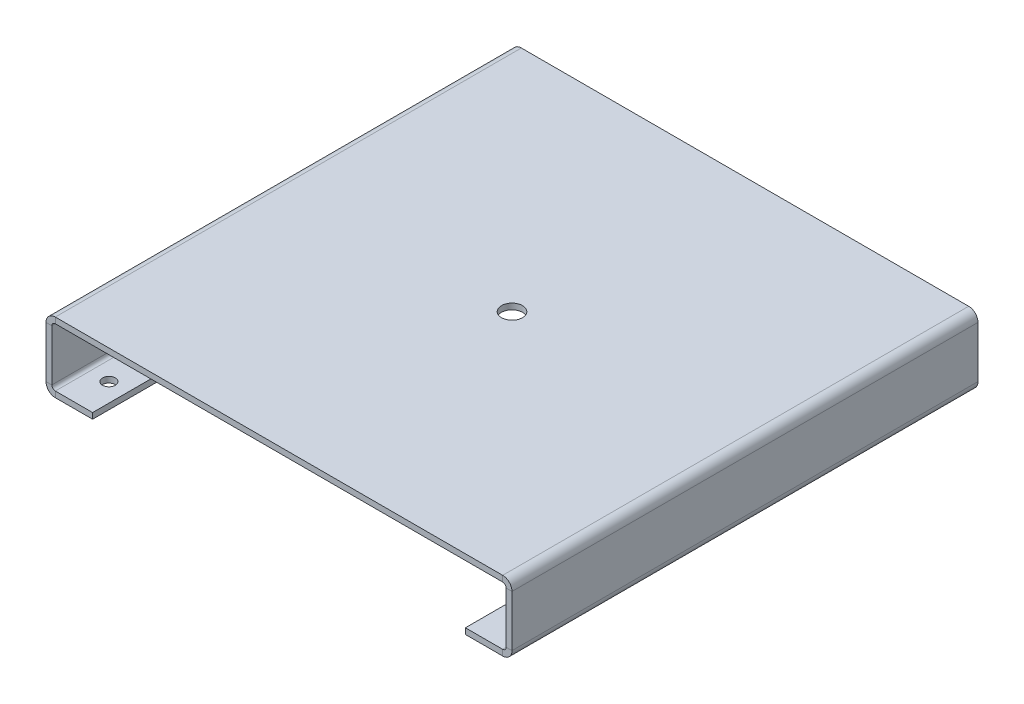
ISO-10303-21;
HEADER;
FILE_DESCRIPTION(('STEP AP214'),'2;1');
FILE_NAME('part.step','',(''),(''),'','','');
FILE_SCHEMA(('AUTOMOTIVE_DESIGN { 1 0 10303 214 1 1 1 1 }'));
ENDSEC;
DATA;
#1=APPLICATION_CONTEXT('core data for automotive mechanical design processes');
#2=APPLICATION_PROTOCOL_DEFINITION('international standard','automotive_design',2000,#1);
#3=PRODUCT_CONTEXT('',#1,'mechanical');
#4=PRODUCT('Part','Part','',(#3));
#5=PRODUCT_RELATED_PRODUCT_CATEGORY('part','',(#4));
#6=PRODUCT_DEFINITION_FORMATION('','',#4);
#7=PRODUCT_DEFINITION_CONTEXT('part definition',#1,'design');
#8=PRODUCT_DEFINITION('design','',#6,#7);
#9=PRODUCT_DEFINITION_SHAPE('','',#8);
#10=(LENGTH_UNIT() NAMED_UNIT(*) SI_UNIT(.MILLI.,.METRE.));
#11=(NAMED_UNIT(*) PLANE_ANGLE_UNIT() SI_UNIT($,.RADIAN.));
#12=(NAMED_UNIT(*) SI_UNIT($,.STERADIAN.) SOLID_ANGLE_UNIT());
#13=UNCERTAINTY_MEASURE_WITH_UNIT(LENGTH_MEASURE(1.E-05),#10,'distance_accuracy_value','');
#14=(GEOMETRIC_REPRESENTATION_CONTEXT(3) GLOBAL_UNCERTAINTY_ASSIGNED_CONTEXT((#13)) GLOBAL_UNIT_ASSIGNED_CONTEXT((#10,
#11,#12)) REPRESENTATION_CONTEXT('',''));
#15=CARTESIAN_POINT('',(0.,0.,0.));
#16=DIRECTION('',(0.,0.,1.));
#17=DIRECTION('',(1.,0.,0.));
#18=AXIS2_PLACEMENT_3D('',#15,#16,#17);
#19=CARTESIAN_POINT('',(12.,4.,-185.));
#20=DIRECTION('',(0.,-1.,0.));
#21=DIRECTION('',(0.,0.,-1.));
#22=AXIS2_PLACEMENT_3D('',#19,#20,#21);
#23=CYLINDRICAL_SURFACE('',#22,2.75);
#24=CARTESIAN_POINT('',(12.,0.,-185.));
#25=DIRECTION('',(0.,-1.,0.));
#26=DIRECTION('',(0.,0.,-1.));
#27=AXIS2_PLACEMENT_3D('',#24,#25,#26);
#28=CIRCLE('',#27,2.75);
#29=CARTESIAN_POINT('',(12.,0.,-187.75));
#30=VERTEX_POINT('',#29);
#31=EDGE_CURVE('E368',#30,#30,#28,.T.);
#32=ORIENTED_EDGE('',*,*,#31,.T.);
#33=EDGE_LOOP('',(#32));
#34=FACE_BOUND('',#33,.T.);
#35=CARTESIAN_POINT('',(12.,2.5,-185.));
#36=DIRECTION('',(0.,-1.,0.));
#37=DIRECTION('',(0.,0.,-1.));
#38=AXIS2_PLACEMENT_3D('',#35,#36,#37);
#39=CIRCLE('',#38,2.75);
#40=CARTESIAN_POINT('',(12.,2.5,-187.75));
#41=VERTEX_POINT('',#40);
#42=EDGE_CURVE('E344',#41,#41,#39,.T.);
#43=ORIENTED_EDGE('',*,*,#42,.F.);
#44=EDGE_LOOP('',(#43));
#45=FACE_BOUND('',#44,.T.);
#46=ADVANCED_FACE('F30',(#34,#45),#23,.F.);
#47=CARTESIAN_POINT('',(12.,4.,-15.));
#48=DIRECTION('',(0.,-1.,0.));
#49=DIRECTION('',(0.,0.,-1.));
#50=AXIS2_PLACEMENT_3D('',#47,#48,#49);
#51=CYLINDRICAL_SURFACE('',#50,2.75);
#52=CARTESIAN_POINT('',(12.,0.,-15.));
#53=DIRECTION('',(0.,-1.,0.));
#54=DIRECTION('',(0.,0.,-1.));
#55=AXIS2_PLACEMENT_3D('',#52,#53,#54);
#56=CIRCLE('',#55,2.75);
#57=CARTESIAN_POINT('',(12.,0.,-17.75));
#58=VERTEX_POINT('',#57);
#59=EDGE_CURVE('E365',#58,#58,#56,.T.);
#60=ORIENTED_EDGE('',*,*,#59,.T.);
#61=EDGE_LOOP('',(#60));
#62=FACE_BOUND('',#61,.T.);
#63=CARTESIAN_POINT('',(12.,2.5,-15.));
#64=DIRECTION('',(0.,-1.,0.));
#65=DIRECTION('',(0.,0.,-1.));
#66=AXIS2_PLACEMENT_3D('',#63,#64,#65);
#67=CIRCLE('',#66,2.75);
#68=CARTESIAN_POINT('',(12.,2.5,-17.75));
#69=VERTEX_POINT('',#68);
#70=EDGE_CURVE('E347',#69,#69,#67,.T.);
#71=ORIENTED_EDGE('',*,*,#70,.F.);
#72=EDGE_LOOP('',(#71));
#73=FACE_BOUND('',#72,.T.);
#74=ADVANCED_FACE('F500',(#62,#73),#51,.F.);
#75=CARTESIAN_POINT('',(20.,403.777958527503,-200.));
#76=DIRECTION('',(-1.,0.,0.));
#77=DIRECTION('',(0.,0.,1.));
#78=AXIS2_PLACEMENT_3D('',#75,#76,#77);
#79=PLANE('',#78);
#80=DIRECTION('',(0.,0.,-1.));
#81=VECTOR('',#80,1.);
#82=CARTESIAN_POINT('',(20.,0.,0.));
#83=LINE('',#82,#81);
#84=CARTESIAN_POINT('',(20.,1.10456723534393E-13,0.));
#85=VERTEX_POINT('',#84);
#86=CARTESIAN_POINT('',(20.,0.,-200.));
#87=VERTEX_POINT('',#86);
#88=EDGE_CURVE('E362',#85,#87,#83,.T.);
#89=ORIENTED_EDGE('',*,*,#88,.T.);
#90=DIRECTION('',(0.,-1.,0.));
#91=VECTOR('',#90,1.);
#92=CARTESIAN_POINT('',(20.,403.777958527503,-200.));
#93=LINE('',#92,#91);
#94=CARTESIAN_POINT('',(20.,2.50000000000011,-200.));
#95=VERTEX_POINT('',#94);
#96=EDGE_CURVE('E350',#95,#87,#93,.T.);
#97=ORIENTED_EDGE('',*,*,#96,.F.);
#98=DIRECTION('',(0.,0.,-1.));
#99=VECTOR('',#98,1.);
#100=CARTESIAN_POINT('',(20.,2.5,-200.));
#101=LINE('',#100,#99);
#102=CARTESIAN_POINT('',(20.,2.5,0.));
#103=VERTEX_POINT('',#102);
#104=EDGE_CURVE('E11',#103,#95,#101,.T.);
#105=ORIENTED_EDGE('',*,*,#104,.F.);
#106=DIRECTION('',(0.,-1.,0.));
#107=VECTOR('',#106,1.);
#108=CARTESIAN_POINT('',(20.,403.777958527503,0.));
#109=LINE('',#108,#107);
#110=EDGE_CURVE('E359',#103,#85,#109,.T.);
#111=ORIENTED_EDGE('',*,*,#110,.T.);
#112=EDGE_LOOP('',(#89,#97,#105,#111));
#113=FACE_BOUND('',#112,.T.);
#114=ADVANCED_FACE('F505',(#113),#79,.F.);
#115=CARTESIAN_POINT('',(0.,403.777958527503,0.));
#116=DIRECTION('',(0.,0.,-1.));
#117=DIRECTION('',(0.,-1.,0.));
#118=AXIS2_PLACEMENT_3D('',#115,#116,#117);
#119=PLANE('',#118);
#120=DIRECTION('',(1.,0.,0.));
#121=VECTOR('',#120,1.);
#122=CARTESIAN_POINT('',(0.,0.,0.));
#123=LINE('',#122,#121);
#124=CARTESIAN_POINT('',(3.99999999999997,0.,0.));
#125=VERTEX_POINT('',#124);
#126=EDGE_CURVE('E357',#125,#85,#123,.T.);
#127=ORIENTED_EDGE('',*,*,#126,.T.);
#128=ORIENTED_EDGE('',*,*,#110,.F.);
#129=DIRECTION('',(1.,0.,0.));
#130=VECTOR('',#129,1.);
#131=CARTESIAN_POINT('',(0.,2.5,0.));
#132=LINE('',#131,#130);
#133=CARTESIAN_POINT('',(3.99999999999998,2.5,0.));
#134=VERTEX_POINT('',#133);
#135=EDGE_CURVE('E40',#134,#103,#132,.T.);
#136=ORIENTED_EDGE('',*,*,#135,.F.);
#137=DIRECTION('',(0.,-1.,0.));
#138=VECTOR('',#137,1.);
#139=CARTESIAN_POINT('',(4.,403.777958527503,0.));
#140=LINE('',#139,#138);
#141=EDGE_CURVE('E354',#134,#125,#140,.T.);
#142=ORIENTED_EDGE('',*,*,#141,.T.);
#143=EDGE_LOOP('',(#127,#128,#136,#142));
#144=FACE_BOUND('',#143,.T.);
#145=ADVANCED_FACE('F512',(#144),#119,.F.);
#146=CARTESIAN_POINT('',(0.,0.,-200.));
#147=DIRECTION('',(0.,-1.,0.));
#148=DIRECTION('',(0.,0.,-1.));
#149=AXIS2_PLACEMENT_3D('',#146,#147,#148);
#150=PLANE('',#149);
#151=DIRECTION('',(0.,0.,1.));
#152=VECTOR('',#151,1.);
#153=CARTESIAN_POINT('',(4.,0.,0.));
#154=LINE('',#153,#152);
#155=CARTESIAN_POINT('',(4.,0.,-200.));
#156=VERTEX_POINT('',#155);
#157=EDGE_CURVE('E370',#156,#125,#154,.T.);
#158=ORIENTED_EDGE('',*,*,#157,.F.);
#159=DIRECTION('',(-1.,0.,0.));
#160=VECTOR('',#159,1.);
#161=CARTESIAN_POINT('',(0.,0.,-200.));
#162=LINE('',#161,#160);
#163=EDGE_CURVE('E352',#87,#156,#162,.T.);
#164=ORIENTED_EDGE('',*,*,#163,.F.);
#165=ORIENTED_EDGE('',*,*,#88,.F.);
#166=ORIENTED_EDGE('',*,*,#126,.F.);
#167=EDGE_LOOP('',(#158,#164,#165,#166));
#168=FACE_BOUND('',#167,.T.);
#169=ORIENTED_EDGE('',*,*,#59,.F.);
#170=EDGE_LOOP('',(#169));
#171=FACE_BOUND('',#170,.T.);
#172=ORIENTED_EDGE('',*,*,#31,.F.);
#173=EDGE_LOOP('',(#172));
#174=FACE_BOUND('',#173,.T.);
#175=ADVANCED_FACE('F516',(#168,#171,#174),#150,.T.);
#176=CARTESIAN_POINT('',(0.,403.777958527503,-200.));
#177=DIRECTION('',(0.,0.,1.));
#178=DIRECTION('',(0.,1.,0.));
#179=AXIS2_PLACEMENT_3D('',#176,#177,#178);
#180=PLANE('',#179);
#181=ORIENTED_EDGE('',*,*,#163,.T.);
#182=DIRECTION('',(0.,-1.,0.));
#183=VECTOR('',#182,1.);
#184=CARTESIAN_POINT('',(4.,403.777958527503,-200.));
#185=LINE('',#184,#183);
#186=CARTESIAN_POINT('',(4.,2.5,-200.));
#187=VERTEX_POINT('',#186);
#188=EDGE_CURVE('E34',#187,#156,#185,.T.);
#189=ORIENTED_EDGE('',*,*,#188,.F.);
#190=DIRECTION('',(-1.,0.,0.));
#191=VECTOR('',#190,1.);
#192=CARTESIAN_POINT('',(0.,2.5,-200.));
#193=LINE('',#192,#191);
#194=EDGE_CURVE('E64',#95,#187,#193,.T.);
#195=ORIENTED_EDGE('',*,*,#194,.F.);
#196=ORIENTED_EDGE('',*,*,#96,.T.);
#197=EDGE_LOOP('',(#181,#189,#195,#196));
#198=FACE_BOUND('',#197,.T.);
#199=ADVANCED_FACE('F519',(#198),#180,.F.);
#200=CARTESIAN_POINT('',(0.,2.5,-200.));
#201=DIRECTION('',(0.,-1.,0.));
#202=DIRECTION('',(0.,0.,-1.));
#203=AXIS2_PLACEMENT_3D('',#200,#201,#202);
#204=PLANE('',#203);
#205=ORIENTED_EDGE('',*,*,#70,.T.);
#206=EDGE_LOOP('',(#205));
#207=FACE_BOUND('',#206,.T.);
#208=ORIENTED_EDGE('',*,*,#42,.T.);
#209=EDGE_LOOP('',(#208));
#210=FACE_BOUND('',#209,.T.);
#211=ORIENTED_EDGE('',*,*,#194,.T.);
#212=DIRECTION('',(0.,0.,1.));
#213=VECTOR('',#212,1.);
#214=CARTESIAN_POINT('',(4.,2.5,0.));
#215=LINE('',#214,#213);
#216=EDGE_CURVE('E68',#187,#134,#215,.T.);
#217=ORIENTED_EDGE('',*,*,#216,.T.);
#218=ORIENTED_EDGE('',*,*,#135,.T.);
#219=ORIENTED_EDGE('',*,*,#104,.T.);
#220=EDGE_LOOP('',(#211,#217,#218,#219));
#221=FACE_BOUND('',#220,.T.);
#222=ADVANCED_FACE('F32',(#207,#210,#221),#204,.F.);
#223=CARTESIAN_POINT('',(188.,4.00000000000006,-185.));
#224=DIRECTION('',(0.,-1.,0.));
#225=DIRECTION('',(0.,0.,-1.));
#226=AXIS2_PLACEMENT_3D('',#223,#224,#225);
#227=CYLINDRICAL_SURFACE('',#226,2.74999999999998);
#228=CARTESIAN_POINT('',(188.,0.,-185.));
#229=DIRECTION('',(0.,-1.,0.));
#230=DIRECTION('',(0.,0.,-1.));
#231=AXIS2_PLACEMENT_3D('',#228,#229,#230);
#232=CIRCLE('',#231,2.74999999999998);
#233=CARTESIAN_POINT('',(188.,0.,-187.75));
#234=VERTEX_POINT('',#233);
#235=EDGE_CURVE('E333',#234,#234,#232,.T.);
#236=ORIENTED_EDGE('',*,*,#235,.T.);
#237=EDGE_LOOP('',(#236));
#238=FACE_BOUND('',#237,.T.);
#239=CARTESIAN_POINT('',(188.,2.50000000000006,-185.));
#240=DIRECTION('',(0.,-1.,0.));
#241=DIRECTION('',(0.,0.,-1.));
#242=AXIS2_PLACEMENT_3D('',#239,#240,#241);
#243=CIRCLE('',#242,2.74999999999998);
#244=CARTESIAN_POINT('',(188.,2.50000000000006,-187.75));
#245=VERTEX_POINT('',#244);
#246=EDGE_CURVE('E309',#245,#245,#243,.T.);
#247=ORIENTED_EDGE('',*,*,#246,.F.);
#248=EDGE_LOOP('',(#247));
#249=FACE_BOUND('',#248,.T.);
#250=ADVANCED_FACE('F525',(#238,#249),#227,.F.);
#251=CARTESIAN_POINT('',(188.,4.00000000000006,-15.));
#252=DIRECTION('',(0.,-1.,0.));
#253=DIRECTION('',(0.,0.,-1.));
#254=AXIS2_PLACEMENT_3D('',#251,#252,#253);
#255=CYLINDRICAL_SURFACE('',#254,2.74999999999998);
#256=CARTESIAN_POINT('',(188.,0.,-15.));
#257=DIRECTION('',(0.,-1.,0.));
#258=DIRECTION('',(0.,0.,-1.));
#259=AXIS2_PLACEMENT_3D('',#256,#257,#258);
#260=CIRCLE('',#259,2.74999999999998);
#261=CARTESIAN_POINT('',(188.,0.,-17.75));
#262=VERTEX_POINT('',#261);
#263=EDGE_CURVE('E330',#262,#262,#260,.T.);
#264=ORIENTED_EDGE('',*,*,#263,.T.);
#265=EDGE_LOOP('',(#264));
#266=FACE_BOUND('',#265,.T.);
#267=CARTESIAN_POINT('',(188.,2.50000000000006,-15.));
#268=DIRECTION('',(0.,-1.,0.));
#269=DIRECTION('',(0.,0.,-1.));
#270=AXIS2_PLACEMENT_3D('',#267,#268,#269);
#271=CIRCLE('',#270,2.74999999999998);
#272=CARTESIAN_POINT('',(188.,2.50000000000006,-17.75));
#273=VERTEX_POINT('',#272);
#274=EDGE_CURVE('E312',#273,#273,#271,.T.);
#275=ORIENTED_EDGE('',*,*,#274,.F.);
#276=EDGE_LOOP('',(#275));
#277=FACE_BOUND('',#276,.T.);
#278=ADVANCED_FACE('F587',(#266,#277),#255,.F.);
#279=CARTESIAN_POINT('',(180.,403.777958527503,-200.));
#280=DIRECTION('',(1.,0.,0.));
#281=DIRECTION('',(0.,1.,0.));
#282=AXIS2_PLACEMENT_3D('',#279,#280,#281);
#283=PLANE('',#282);
#284=DIRECTION('',(0.,0.,1.));
#285=VECTOR('',#284,1.);
#286=CARTESIAN_POINT('',(180.,0.,0.));
#287=LINE('',#286,#285);
#288=CARTESIAN_POINT('',(180.,1.66533453693773E-13,-200.));
#289=VERTEX_POINT('',#288);
#290=CARTESIAN_POINT('',(180.,0.,0.));
#291=VERTEX_POINT('',#290);
#292=EDGE_CURVE('E327',#289,#291,#287,.T.);
#293=ORIENTED_EDGE('',*,*,#292,.T.);
#294=DIRECTION('',(0.,-1.,0.));
#295=VECTOR('',#294,1.);
#296=CARTESIAN_POINT('',(180.,403.777958527503,0.));
#297=LINE('',#296,#295);
#298=CARTESIAN_POINT('',(180.,2.50000000000017,0.));
#299=VERTEX_POINT('',#298);
#300=EDGE_CURVE('E315',#299,#291,#297,.T.);
#301=ORIENTED_EDGE('',*,*,#300,.F.);
#302=DIRECTION('',(0.,0.,1.));
#303=VECTOR('',#302,1.);
#304=CARTESIAN_POINT('',(180.,2.50000000000006,-200.));
#305=LINE('',#304,#303);
#306=CARTESIAN_POINT('',(180.,2.50000000000006,-200.));
#307=VERTEX_POINT('',#306);
#308=EDGE_CURVE('E77',#307,#299,#305,.T.);
#309=ORIENTED_EDGE('',*,*,#308,.F.);
#310=DIRECTION('',(0.,-1.,0.));
#311=VECTOR('',#310,1.);
#312=CARTESIAN_POINT('',(180.,403.777958527503,-200.));
#313=LINE('',#312,#311);
#314=EDGE_CURVE('E324',#307,#289,#313,.T.);
#315=ORIENTED_EDGE('',*,*,#314,.T.);
#316=EDGE_LOOP('',(#293,#301,#309,#315));
#317=FACE_BOUND('',#316,.T.);
#318=ADVANCED_FACE('F483',(#317),#283,.F.);
#319=CARTESIAN_POINT('',(0.,403.777958527503,-200.));
#320=DIRECTION('',(0.,0.,1.));
#321=DIRECTION('',(0.,1.,0.));
#322=AXIS2_PLACEMENT_3D('',#319,#320,#321);
#323=PLANE('',#322);
#324=DIRECTION('',(-1.,0.,0.));
#325=VECTOR('',#324,1.);
#326=CARTESIAN_POINT('',(0.,0.,-200.));
#327=LINE('',#326,#325);
#328=CARTESIAN_POINT('',(196.,0.,-200.));
#329=VERTEX_POINT('',#328);
#330=EDGE_CURVE('E322',#329,#289,#327,.T.);
#331=ORIENTED_EDGE('',*,*,#330,.T.);
#332=ORIENTED_EDGE('',*,*,#314,.F.);
#333=DIRECTION('',(-1.,0.,0.));
#334=VECTOR('',#333,1.);
#335=CARTESIAN_POINT('',(0.,2.50000000000009,-200.));
#336=LINE('',#335,#334);
#337=CARTESIAN_POINT('',(196.,2.50000000000006,-200.));
#338=VERTEX_POINT('',#337);
#339=EDGE_CURVE('E305',#338,#307,#336,.T.);
#340=ORIENTED_EDGE('',*,*,#339,.F.);
#341=DIRECTION('',(0.,-1.,0.));
#342=VECTOR('',#341,1.);
#343=CARTESIAN_POINT('',(196.,403.777958527503,-200.));
#344=LINE('',#343,#342);
#345=EDGE_CURVE('E319',#338,#329,#344,.T.);
#346=ORIENTED_EDGE('',*,*,#345,.T.);
#347=EDGE_LOOP('',(#331,#332,#340,#346));
#348=FACE_BOUND('',#347,.T.);
#349=ADVANCED_FACE('F486',(#348),#323,.F.);
#350=CARTESIAN_POINT('',(0.,0.,-200.));
#351=DIRECTION('',(0.,-1.,0.));
#352=DIRECTION('',(0.,0.,-1.));
#353=AXIS2_PLACEMENT_3D('',#350,#351,#352);
#354=PLANE('',#353);
#355=DIRECTION('',(0.,0.,-1.));
#356=VECTOR('',#355,1.);
#357=CARTESIAN_POINT('',(196.,0.,-200.));
#358=LINE('',#357,#356);
#359=CARTESIAN_POINT('',(196.,0.,0.));
#360=VERTEX_POINT('',#359);
#361=EDGE_CURVE('E336',#360,#329,#358,.T.);
#362=ORIENTED_EDGE('',*,*,#361,.F.);
#363=DIRECTION('',(1.,0.,0.));
#364=VECTOR('',#363,1.);
#365=CARTESIAN_POINT('',(0.,0.,0.));
#366=LINE('',#365,#364);
#367=EDGE_CURVE('E317',#291,#360,#366,.T.);
#368=ORIENTED_EDGE('',*,*,#367,.F.);
#369=ORIENTED_EDGE('',*,*,#292,.F.);
#370=ORIENTED_EDGE('',*,*,#330,.F.);
#371=EDGE_LOOP('',(#362,#368,#369,#370));
#372=FACE_BOUND('',#371,.T.);
#373=ORIENTED_EDGE('',*,*,#263,.F.);
#374=EDGE_LOOP('',(#373));
#375=FACE_BOUND('',#374,.T.);
#376=ORIENTED_EDGE('',*,*,#235,.F.);
#377=EDGE_LOOP('',(#376));
#378=FACE_BOUND('',#377,.T.);
#379=ADVANCED_FACE('F476',(#372,#375,#378),#354,.T.);
#380=CARTESIAN_POINT('',(0.,403.777958527503,0.));
#381=DIRECTION('',(0.,0.,-1.));
#382=DIRECTION('',(0.,-1.,0.));
#383=AXIS2_PLACEMENT_3D('',#380,#381,#382);
#384=PLANE('',#383);
#385=ORIENTED_EDGE('',*,*,#367,.T.);
#386=DIRECTION('',(0.,-1.,0.));
#387=VECTOR('',#386,1.);
#388=CARTESIAN_POINT('',(196.,403.777958527503,0.));
#389=LINE('',#388,#387);
#390=CARTESIAN_POINT('',(196.,2.50000000000006,0.));
#391=VERTEX_POINT('',#390);
#392=EDGE_CURVE('E275',#391,#360,#389,.T.);
#393=ORIENTED_EDGE('',*,*,#392,.F.);
#394=DIRECTION('',(1.,0.,0.));
#395=VECTOR('',#394,1.);
#396=CARTESIAN_POINT('',(0.,2.50000000000009,0.));
#397=LINE('',#396,#395);
#398=EDGE_CURVE('E94',#299,#391,#397,.T.);
#399=ORIENTED_EDGE('',*,*,#398,.F.);
#400=ORIENTED_EDGE('',*,*,#300,.T.);
#401=EDGE_LOOP('',(#385,#393,#399,#400));
#402=FACE_BOUND('',#401,.T.);
#403=ADVANCED_FACE('F480',(#402),#384,.F.);
#404=CARTESIAN_POINT('',(0.,2.50000000000009,-200.));
#405=DIRECTION('',(0.,-1.,0.));
#406=DIRECTION('',(0.,0.,-1.));
#407=AXIS2_PLACEMENT_3D('',#404,#405,#406);
#408=PLANE('',#407);
#409=ORIENTED_EDGE('',*,*,#274,.T.);
#410=EDGE_LOOP('',(#409));
#411=FACE_BOUND('',#410,.T.);
#412=ORIENTED_EDGE('',*,*,#246,.T.);
#413=EDGE_LOOP('',(#412));
#414=FACE_BOUND('',#413,.T.);
#415=ORIENTED_EDGE('',*,*,#398,.T.);
#416=DIRECTION('',(0.,0.,-1.));
#417=VECTOR('',#416,1.);
#418=CARTESIAN_POINT('',(196.,2.50000000000006,-200.));
#419=LINE('',#418,#417);
#420=EDGE_CURVE('E98',#391,#338,#419,.T.);
#421=ORIENTED_EDGE('',*,*,#420,.T.);
#422=ORIENTED_EDGE('',*,*,#339,.T.);
#423=ORIENTED_EDGE('',*,*,#308,.T.);
#424=EDGE_LOOP('',(#415,#421,#422,#423));
#425=FACE_BOUND('',#424,.T.);
#426=ADVANCED_FACE('F487',(#411,#414,#425),#408,.F.);
#427=CARTESIAN_POINT('',(-204.912723456901,30.,-200.));
#428=DIRECTION('',(0.,0.,1.));
#429=DIRECTION('',(-1.,0.,0.));
#430=AXIS2_PLACEMENT_3D('',#427,#428,#429);
#431=PLANE('',#430);
#432=DIRECTION('',(1.,0.,0.));
#433=VECTOR('',#432,1.);
#434=CARTESIAN_POINT('',(-204.912723456901,26.,-200.));
#435=LINE('',#434,#433);
#436=CARTESIAN_POINT('',(197.5,26.,-200.));
#437=VERTEX_POINT('',#436);
#438=CARTESIAN_POINT('',(200.,26.,-200.));
#439=VERTEX_POINT('',#438);
#440=EDGE_CURVE('E294',#437,#439,#435,.T.);
#441=ORIENTED_EDGE('',*,*,#440,.T.);
#442=DIRECTION('',(0.,-1.,0.));
#443=VECTOR('',#442,1.);
#444=CARTESIAN_POINT('',(200.,30.,-200.));
#445=LINE('',#444,#443);
#446=CARTESIAN_POINT('',(200.,4.00000000000006,-200.));
#447=VERTEX_POINT('',#446);
#448=EDGE_CURVE('E291',#439,#447,#445,.T.);
#449=ORIENTED_EDGE('',*,*,#448,.T.);
#450=DIRECTION('',(1.,0.,0.));
#451=VECTOR('',#450,1.);
#452=CARTESIAN_POINT('',(-204.912723456901,4.00000000000006,-200.));
#453=LINE('',#452,#451);
#454=CARTESIAN_POINT('',(197.5,4.00000000000006,-200.));
#455=VERTEX_POINT('',#454);
#456=EDGE_CURVE('E297',#455,#447,#453,.T.);
#457=ORIENTED_EDGE('',*,*,#456,.F.);
#458=DIRECTION('',(0.,-1.,0.));
#459=VECTOR('',#458,1.);
#460=CARTESIAN_POINT('',(197.5,30.,-200.));
#461=LINE('',#460,#459);
#462=EDGE_CURVE('E276',#437,#455,#461,.T.);
#463=ORIENTED_EDGE('',*,*,#462,.F.);
#464=EDGE_LOOP('',(#441,#449,#457,#463));
#465=FACE_BOUND('',#464,.T.);
#466=ADVANCED_FACE('F466',(#465),#431,.F.);
#467=CARTESIAN_POINT('',(200.,30.,0.));
#468=DIRECTION('',(-1.,0.,0.));
#469=DIRECTION('',(0.,0.,1.));
#470=AXIS2_PLACEMENT_3D('',#467,#468,#469);
#471=PLANE('',#470);
#472=DIRECTION('',(0.,0.,1.));
#473=VECTOR('',#472,1.);
#474=CARTESIAN_POINT('',(200.,4.00000000000006,-200.));
#475=LINE('',#474,#473);
#476=CARTESIAN_POINT('',(200.,4.00000000000006,0.));
#477=VERTEX_POINT('',#476);
#478=EDGE_CURVE('E299',#447,#477,#475,.T.);
#479=ORIENTED_EDGE('',*,*,#478,.F.);
#480=ORIENTED_EDGE('',*,*,#448,.F.);
#481=DIRECTION('',(0.,0.,1.));
#482=VECTOR('',#481,1.);
#483=CARTESIAN_POINT('',(200.,26.,-200.));
#484=LINE('',#483,#482);
#485=CARTESIAN_POINT('',(200.,26.,0.));
#486=VERTEX_POINT('',#485);
#487=EDGE_CURVE('E288',#439,#486,#484,.T.);
#488=ORIENTED_EDGE('',*,*,#487,.T.);
#489=DIRECTION('',(0.,-1.,0.));
#490=VECTOR('',#489,1.);
#491=CARTESIAN_POINT('',(200.,30.,0.));
#492=LINE('',#491,#490);
#493=EDGE_CURVE('E285',#486,#477,#492,.T.);
#494=ORIENTED_EDGE('',*,*,#493,.T.);
#495=EDGE_LOOP('',(#479,#480,#488,#494));
#496=FACE_BOUND('',#495,.T.);
#497=ADVANCED_FACE('F447',(#496),#471,.F.);
#498=CARTESIAN_POINT('',(-204.912723456901,30.,0.));
#499=DIRECTION('',(0.,0.,1.));
#500=DIRECTION('',(-1.,0.,0.));
#501=AXIS2_PLACEMENT_3D('',#498,#499,#500);
#502=PLANE('',#501);
#503=ORIENTED_EDGE('',*,*,#493,.F.);
#504=DIRECTION('',(1.,0.,0.));
#505=VECTOR('',#504,1.);
#506=CARTESIAN_POINT('',(-204.912723456901,26.,0.));
#507=LINE('',#506,#505);
#508=CARTESIAN_POINT('',(197.5,26.,-2.22044604925031E-13));
#509=VERTEX_POINT('',#508);
#510=EDGE_CURVE('E301',#509,#486,#507,.T.);
#511=ORIENTED_EDGE('',*,*,#510,.F.);
#512=DIRECTION('',(0.,-1.,0.));
#513=VECTOR('',#512,1.);
#514=CARTESIAN_POINT('',(197.5,30.,0.));
#515=LINE('',#514,#513);
#516=CARTESIAN_POINT('',(197.5,4.00000000000003,0.));
#517=VERTEX_POINT('',#516);
#518=EDGE_CURVE('E282',#509,#517,#515,.T.);
#519=ORIENTED_EDGE('',*,*,#518,.T.);
#520=DIRECTION('',(1.,0.,0.));
#521=VECTOR('',#520,1.);
#522=CARTESIAN_POINT('',(-204.912723456901,4.00000000000006,0.));
#523=LINE('',#522,#521);
#524=EDGE_CURVE('E279',#517,#477,#523,.T.);
#525=ORIENTED_EDGE('',*,*,#524,.T.);
#526=EDGE_LOOP('',(#503,#511,#519,#525));
#527=FACE_BOUND('',#526,.T.);
#528=ADVANCED_FACE('F450',(#527),#502,.T.);
#529=CARTESIAN_POINT('',(197.5,30.,0.));
#530=DIRECTION('',(-1.,0.,0.));
#531=DIRECTION('',(0.,0.,1.));
#532=AXIS2_PLACEMENT_3D('',#529,#530,#531);
#533=PLANE('',#532);
#534=ORIENTED_EDGE('',*,*,#462,.T.);
#535=DIRECTION('',(0.,0.,1.));
#536=VECTOR('',#535,1.);
#537=CARTESIAN_POINT('',(197.5,4.00000000000006,-200.));
#538=LINE('',#537,#536);
#539=EDGE_CURVE('E272',#455,#517,#538,.T.);
#540=ORIENTED_EDGE('',*,*,#539,.T.);
#541=ORIENTED_EDGE('',*,*,#518,.F.);
#542=DIRECTION('',(0.,0.,1.));
#543=VECTOR('',#542,1.);
#544=CARTESIAN_POINT('',(197.5,26.,-200.));
#545=LINE('',#544,#543);
#546=EDGE_CURVE('E271',#437,#509,#545,.T.);
#547=ORIENTED_EDGE('',*,*,#546,.F.);
#548=EDGE_LOOP('',(#534,#540,#541,#547));
#549=FACE_BOUND('',#548,.T.);
#550=ADVANCED_FACE('F461',(#549),#533,.T.);
#551=CARTESIAN_POINT('',(0.,30.,-200.));
#552=DIRECTION('',(0.,-1.,0.));
#553=DIRECTION('',(0.,0.,-1.));
#554=AXIS2_PLACEMENT_3D('',#551,#552,#553);
#555=PLANE('',#554);
#556=CARTESIAN_POINT('',(100.,30.,-100.));
#557=DIRECTION('',(0.,1.,0.));
#558=DIRECTION('',(0.,0.,1.));
#559=AXIS2_PLACEMENT_3D('',#556,#557,#558);
#560=CIRCLE('',#559,4.50000000000001);
#561=CARTESIAN_POINT('',(100.,30.,-95.5));
#562=VERTEX_POINT('',#561);
#563=EDGE_CURVE('E241',#562,#562,#560,.T.);
#564=ORIENTED_EDGE('',*,*,#563,.F.);
#565=EDGE_LOOP('',(#564));
#566=FACE_BOUND('',#565,.T.);
#567=DIRECTION('',(0.,0.,1.));
#568=VECTOR('',#567,1.);
#569=CARTESIAN_POINT('',(196.,30.,-200.));
#570=LINE('',#569,#568);
#571=CARTESIAN_POINT('',(196.,30.,-200.));
#572=VERTEX_POINT('',#571);
#573=CARTESIAN_POINT('',(196.,30.,0.));
#574=VERTEX_POINT('',#573);
#575=EDGE_CURVE('E253',#572,#574,#570,.T.);
#576=ORIENTED_EDGE('',*,*,#575,.F.);
#577=DIRECTION('',(-1.,0.,0.));
#578=VECTOR('',#577,1.);
#579=CARTESIAN_POINT('',(0.,30.,-200.));
#580=LINE('',#579,#578);
#581=CARTESIAN_POINT('',(4.,30.,-200.));
#582=VERTEX_POINT('',#581);
#583=EDGE_CURVE('E247',#572,#582,#580,.T.);
#584=ORIENTED_EDGE('',*,*,#583,.T.);
#585=DIRECTION('',(0.,0.,1.));
#586=VECTOR('',#585,1.);
#587=CARTESIAN_POINT('',(4.,30.,-200.));
#588=LINE('',#587,#586);
#589=CARTESIAN_POINT('',(4.,30.,0.));
#590=VERTEX_POINT('',#589);
#591=EDGE_CURVE('E268',#582,#590,#588,.T.);
#592=ORIENTED_EDGE('',*,*,#591,.T.);
#593=DIRECTION('',(1.,0.,0.));
#594=VECTOR('',#593,1.);
#595=CARTESIAN_POINT('',(0.,30.,0.));
#596=LINE('',#595,#594);
#597=EDGE_CURVE('E244',#590,#574,#596,.T.);
#598=ORIENTED_EDGE('',*,*,#597,.T.);
#599=EDGE_LOOP('',(#576,#584,#592,#598));
#600=FACE_BOUND('',#599,.T.);
#601=ADVANCED_FACE('F566',(#566,#600),#555,.F.);
#602=CARTESIAN_POINT('',(0.,27.5,-200.));
#603=DIRECTION('',(0.,-1.,0.));
#604=DIRECTION('',(0.,0.,-1.));
#605=AXIS2_PLACEMENT_3D('',#602,#603,#604);
#606=PLANE('',#605);
#607=CARTESIAN_POINT('',(100.,27.5,-100.));
#608=DIRECTION('',(0.,-1.,0.));
#609=DIRECTION('',(0.,0.,-1.));
#610=AXIS2_PLACEMENT_3D('',#607,#608,#609);
#611=CIRCLE('',#610,4.50000000000001);
#612=CARTESIAN_POINT('',(100.,27.5,-104.5));
#613=VERTEX_POINT('',#612);
#614=EDGE_CURVE('E193',#613,#613,#611,.T.);
#615=ORIENTED_EDGE('',*,*,#614,.F.);
#616=EDGE_LOOP('',(#615));
#617=FACE_BOUND('',#616,.T.);
#618=DIRECTION('',(-1.,0.,0.));
#619=VECTOR('',#618,1.);
#620=CARTESIAN_POINT('',(0.,27.5,-200.));
#621=LINE('',#620,#619);
#622=CARTESIAN_POINT('',(196.,27.5,-200.));
#623=VERTEX_POINT('',#622);
#624=CARTESIAN_POINT('',(4.,27.5,-200.));
#625=VERTEX_POINT('',#624);
#626=EDGE_CURVE('E235',#623,#625,#621,.T.);
#627=ORIENTED_EDGE('',*,*,#626,.F.);
#628=DIRECTION('',(0.,0.,1.));
#629=VECTOR('',#628,1.);
#630=CARTESIAN_POINT('',(196.,27.5000000000001,-200.));
#631=LINE('',#630,#629);
#632=CARTESIAN_POINT('',(196.,27.5,-2.22044604925031E-13));
#633=VERTEX_POINT('',#632);
#634=EDGE_CURVE('E250',#623,#633,#631,.T.);
#635=ORIENTED_EDGE('',*,*,#634,.T.);
#636=DIRECTION('',(1.,0.,0.));
#637=VECTOR('',#636,1.);
#638=CARTESIAN_POINT('',(0.,27.5,0.));
#639=LINE('',#638,#637);
#640=CARTESIAN_POINT('',(4.,27.5,0.));
#641=VERTEX_POINT('',#640);
#642=EDGE_CURVE('E238',#641,#633,#639,.T.);
#643=ORIENTED_EDGE('',*,*,#642,.F.);
#644=DIRECTION('',(0.,0.,1.));
#645=VECTOR('',#644,1.);
#646=CARTESIAN_POINT('',(4.,27.5000000000001,-200.));
#647=LINE('',#646,#645);
#648=EDGE_CURVE('E266',#625,#641,#647,.T.);
#649=ORIENTED_EDGE('',*,*,#648,.F.);
#650=EDGE_LOOP('',(#627,#635,#643,#649));
#651=FACE_BOUND('',#650,.T.);
#652=ADVANCED_FACE('F430',(#617,#651),#606,.T.);
#653=CARTESIAN_POINT('',(100.,26.,-100.));
#654=DIRECTION('',(0.,1.,0.));
#655=DIRECTION('',(0.,0.,1.));
#656=AXIS2_PLACEMENT_3D('',#653,#654,#655);
#657=CYLINDRICAL_SURFACE('',#656,4.50000000000001);
#658=ORIENTED_EDGE('',*,*,#614,.T.);
#659=EDGE_LOOP('',(#658));
#660=FACE_BOUND('',#659,.T.);
#661=ORIENTED_EDGE('',*,*,#563,.T.);
#662=EDGE_LOOP('',(#661));
#663=FACE_BOUND('',#662,.T.);
#664=ADVANCED_FACE('F565',(#660,#663),#657,.F.);
#665=CARTESIAN_POINT('',(0.,-526.987150437231,-200.));
#666=DIRECTION('',(0.,0.,-1.));
#667=DIRECTION('',(0.,1.,0.));
#668=AXIS2_PLACEMENT_3D('',#665,#666,#667);
#669=PLANE('',#668);
#670=ORIENTED_EDGE('',*,*,#583,.F.);
#671=DIRECTION('',(0.,1.,0.));
#672=VECTOR('',#671,1.);
#673=CARTESIAN_POINT('',(196.,-526.987150437231,-200.));
#674=LINE('',#673,#672);
#675=EDGE_CURVE('E264',#623,#572,#674,.T.);
#676=ORIENTED_EDGE('',*,*,#675,.F.);
#677=ORIENTED_EDGE('',*,*,#626,.T.);
#678=DIRECTION('',(0.,1.,0.));
#679=VECTOR('',#678,1.);
#680=CARTESIAN_POINT('',(4.,-526.987150437231,-200.));
#681=LINE('',#680,#679);
#682=EDGE_CURVE('E255',#625,#582,#681,.T.);
#683=ORIENTED_EDGE('',*,*,#682,.T.);
#684=EDGE_LOOP('',(#670,#676,#677,#683));
#685=FACE_BOUND('',#684,.T.);
#686=ADVANCED_FACE('F435',(#685),#669,.T.);
#687=CARTESIAN_POINT('',(0.,-526.987150437231,0.));
#688=DIRECTION('',(0.,0.,1.));
#689=DIRECTION('',(0.,-1.,0.));
#690=AXIS2_PLACEMENT_3D('',#687,#688,#689);
#691=PLANE('',#690);
#692=ORIENTED_EDGE('',*,*,#597,.F.);
#693=DIRECTION('',(0.,1.,0.));
#694=VECTOR('',#693,1.);
#695=CARTESIAN_POINT('',(4.,-526.987150437231,0.));
#696=LINE('',#695,#694);
#697=EDGE_CURVE('E258',#641,#590,#696,.T.);
#698=ORIENTED_EDGE('',*,*,#697,.F.);
#699=ORIENTED_EDGE('',*,*,#642,.T.);
#700=DIRECTION('',(0.,1.,0.));
#701=VECTOR('',#700,1.);
#702=CARTESIAN_POINT('',(196.,-526.987150437231,0.));
#703=LINE('',#702,#701);
#704=EDGE_CURVE('E261',#633,#574,#703,.T.);
#705=ORIENTED_EDGE('',*,*,#704,.T.);
#706=EDGE_LOOP('',(#692,#698,#699,#705));
#707=FACE_BOUND('',#706,.T.);
#708=ADVANCED_FACE('F556',(#707),#691,.T.);
#709=CARTESIAN_POINT('',(2.5,30.,0.));
#710=DIRECTION('',(1.,0.,0.));
#711=DIRECTION('',(0.,0.,-1.));
#712=AXIS2_PLACEMENT_3D('',#709,#710,#711);
#713=PLANE('',#712);
#714=DIRECTION('',(0.,-1.,0.));
#715=VECTOR('',#714,1.);
#716=CARTESIAN_POINT('',(2.5,30.,0.));
#717=LINE('',#716,#715);
#718=CARTESIAN_POINT('',(2.5,26.,0.));
#719=VERTEX_POINT('',#718);
#720=CARTESIAN_POINT('',(2.5,4.,0.));
#721=VERTEX_POINT('',#720);
#722=EDGE_CURVE('E217',#719,#721,#717,.T.);
#723=ORIENTED_EDGE('',*,*,#722,.T.);
#724=DIRECTION('',(0.,0.,-1.));
#725=VECTOR('',#724,1.);
#726=CARTESIAN_POINT('',(2.5,4.,0.));
#727=LINE('',#726,#725);
#728=CARTESIAN_POINT('',(2.5,4.,-200.));
#729=VERTEX_POINT('',#728);
#730=EDGE_CURVE('E201',#721,#729,#727,.T.);
#731=ORIENTED_EDGE('',*,*,#730,.T.);
#732=DIRECTION('',(0.,-1.,0.));
#733=VECTOR('',#732,1.);
#734=CARTESIAN_POINT('',(2.5,30.,-200.));
#735=LINE('',#734,#733);
#736=CARTESIAN_POINT('',(2.5,26.,-200.));
#737=VERTEX_POINT('',#736);
#738=EDGE_CURVE('E194',#737,#729,#735,.T.);
#739=ORIENTED_EDGE('',*,*,#738,.F.);
#740=DIRECTION('',(0.,0.,1.));
#741=VECTOR('',#740,1.);
#742=CARTESIAN_POINT('',(2.5,26.,-200.));
#743=LINE('',#742,#741);
#744=EDGE_CURVE('E218',#737,#719,#743,.T.);
#745=ORIENTED_EDGE('',*,*,#744,.T.);
#746=EDGE_LOOP('',(#723,#731,#739,#745));
#747=FACE_BOUND('',#746,.T.);
#748=ADVANCED_FACE('F215',(#747),#713,.T.);
#749=CARTESIAN_POINT('',(404.912723456901,30.,0.));
#750=DIRECTION('',(0.,0.,-1.));
#751=DIRECTION('',(-1.,0.,0.));
#752=AXIS2_PLACEMENT_3D('',#749,#750,#751);
#753=PLANE('',#752);
#754=DIRECTION('',(-1.,0.,0.));
#755=VECTOR('',#754,1.);
#756=CARTESIAN_POINT('',(404.912723456901,26.,0.));
#757=LINE('',#756,#755);
#758=CARTESIAN_POINT('',(0.,26.,0.));
#759=VERTEX_POINT('',#758);
#760=EDGE_CURVE('E220',#719,#759,#757,.T.);
#761=ORIENTED_EDGE('',*,*,#760,.T.);
#762=DIRECTION('',(0.,-1.,0.));
#763=VECTOR('',#762,1.);
#764=CARTESIAN_POINT('',(0.,30.,0.));
#765=LINE('',#764,#763);
#766=CARTESIAN_POINT('',(0.,4.,0.));
#767=VERTEX_POINT('',#766);
#768=EDGE_CURVE('E412',#759,#767,#765,.T.);
#769=ORIENTED_EDGE('',*,*,#768,.T.);
#770=DIRECTION('',(-1.,0.,0.));
#771=VECTOR('',#770,1.);
#772=CARTESIAN_POINT('',(404.912723456901,4.,0.));
#773=LINE('',#772,#771);
#774=EDGE_CURVE('E222',#721,#767,#773,.T.);
#775=ORIENTED_EDGE('',*,*,#774,.F.);
#776=ORIENTED_EDGE('',*,*,#722,.F.);
#777=EDGE_LOOP('',(#761,#769,#775,#776));
#778=FACE_BOUND('',#777,.T.);
#779=ADVANCED_FACE('F416',(#778),#753,.F.);
#780=CARTESIAN_POINT('',(0.,30.,0.));
#781=DIRECTION('',(1.,0.,0.));
#782=DIRECTION('',(0.,0.,-1.));
#783=AXIS2_PLACEMENT_3D('',#780,#781,#782);
#784=PLANE('',#783);
#785=DIRECTION('',(0.,0.,-1.));
#786=VECTOR('',#785,1.);
#787=CARTESIAN_POINT('',(0.,4.,0.));
#788=LINE('',#787,#786);
#789=CARTESIAN_POINT('',(0.,4.,-200.));
#790=VERTEX_POINT('',#789);
#791=EDGE_CURVE('E227',#767,#790,#788,.T.);
#792=ORIENTED_EDGE('',*,*,#791,.F.);
#793=ORIENTED_EDGE('',*,*,#768,.F.);
#794=DIRECTION('',(0.,0.,1.));
#795=VECTOR('',#794,1.);
#796=CARTESIAN_POINT('',(0.,26.,-200.));
#797=LINE('',#796,#795);
#798=CARTESIAN_POINT('',(0.,26.,-200.));
#799=VERTEX_POINT('',#798);
#800=EDGE_CURVE('E229',#799,#759,#797,.T.);
#801=ORIENTED_EDGE('',*,*,#800,.F.);
#802=DIRECTION('',(0.,-1.,0.));
#803=VECTOR('',#802,1.);
#804=CARTESIAN_POINT('',(0.,30.,-200.));
#805=LINE('',#804,#803);
#806=EDGE_CURVE('E212',#799,#790,#805,.T.);
#807=ORIENTED_EDGE('',*,*,#806,.T.);
#808=EDGE_LOOP('',(#792,#793,#801,#807));
#809=FACE_BOUND('',#808,.T.);
#810=ADVANCED_FACE('F537',(#809),#784,.F.);
#811=CARTESIAN_POINT('',(404.912723456901,30.,-200.));
#812=DIRECTION('',(0.,0.,-1.));
#813=DIRECTION('',(-1.,0.,0.));
#814=AXIS2_PLACEMENT_3D('',#811,#812,#813);
#815=PLANE('',#814);
#816=ORIENTED_EDGE('',*,*,#806,.F.);
#817=DIRECTION('',(-1.,0.,0.));
#818=VECTOR('',#817,1.);
#819=CARTESIAN_POINT('',(404.912723456901,26.,-200.));
#820=LINE('',#819,#818);
#821=EDGE_CURVE('E209',#737,#799,#820,.T.);
#822=ORIENTED_EDGE('',*,*,#821,.F.);
#823=ORIENTED_EDGE('',*,*,#738,.T.);
#824=DIRECTION('',(-1.,0.,0.));
#825=VECTOR('',#824,1.);
#826=CARTESIAN_POINT('',(404.912723456901,4.,-200.));
#827=LINE('',#826,#825);
#828=EDGE_CURVE('E182',#729,#790,#827,.T.);
#829=ORIENTED_EDGE('',*,*,#828,.T.);
#830=EDGE_LOOP('',(#816,#822,#823,#829));
#831=FACE_BOUND('',#830,.T.);
#832=ADVANCED_FACE('F208',(#831),#815,.T.);
#833=CARTESIAN_POINT('',(4.,26.,0.));
#834=DIRECTION('',(0.,0.,1.));
#835=DIRECTION('',(1.,0.,0.));
#836=AXIS2_PLACEMENT_3D('',#833,#834,#835);
#837=PLANE('',#836);
#838=ORIENTED_EDGE('',*,*,#760,.F.);
#839=CARTESIAN_POINT('',(4.,26.,0.));
#840=DIRECTION('',(0.,0.,1.));
#841=DIRECTION('',(1.,0.,0.));
#842=AXIS2_PLACEMENT_3D('',#839,#840,#841);
#843=CIRCLE('',#842,1.5);
#844=EDGE_CURVE('E404',#719,#641,#843,.F.);
#845=ORIENTED_EDGE('',*,*,#844,.T.);
#846=ORIENTED_EDGE('',*,*,#697,.T.);
#847=CARTESIAN_POINT('',(4.,26.,0.));
#848=DIRECTION('',(0.,0.,1.));
#849=DIRECTION('',(1.,0.,0.));
#850=AXIS2_PLACEMENT_3D('',#847,#848,#849);
#851=CIRCLE('',#850,4.);
#852=EDGE_CURVE('E232',#759,#590,#851,.F.);
#853=ORIENTED_EDGE('',*,*,#852,.F.);
#854=EDGE_LOOP('',(#838,#845,#846,#853));
#855=FACE_BOUND('',#854,.T.);
#856=ADVANCED_FACE('F421',(#855),#837,.T.);
#857=CARTESIAN_POINT('',(4.,26.,-200.));
#858=DIRECTION('',(0.,0.,-1.));
#859=DIRECTION('',(-1.,0.,0.));
#860=AXIS2_PLACEMENT_3D('',#857,#858,#859);
#861=PLANE('',#860);
#862=ORIENTED_EDGE('',*,*,#682,.F.);
#863=CARTESIAN_POINT('',(4.,26.,-200.));
#864=DIRECTION('',(0.,0.,1.));
#865=DIRECTION('',(1.,0.,0.));
#866=AXIS2_PLACEMENT_3D('',#863,#864,#865);
#867=CIRCLE('',#866,1.5);
#868=EDGE_CURVE('E402',#625,#737,#867,.T.);
#869=ORIENTED_EDGE('',*,*,#868,.T.);
#870=ORIENTED_EDGE('',*,*,#821,.T.);
#871=CARTESIAN_POINT('',(4.,26.,-200.));
#872=DIRECTION('',(0.,0.,1.));
#873=DIRECTION('',(1.,0.,0.));
#874=AXIS2_PLACEMENT_3D('',#871,#872,#873);
#875=CIRCLE('',#874,4.);
#876=EDGE_CURVE('E407',#582,#799,#875,.T.);
#877=ORIENTED_EDGE('',*,*,#876,.F.);
#878=EDGE_LOOP('',(#862,#869,#870,#877));
#879=FACE_BOUND('',#878,.T.);
#880=ADVANCED_FACE('F543',(#879),#861,.T.);
#881=CARTESIAN_POINT('',(4.,26.,-548.410993907936));
#882=DIRECTION('',(0.,0.,1.));
#883=DIRECTION('',(1.,0.,0.));
#884=AXIS2_PLACEMENT_3D('',#881,#882,#883);
#885=CYLINDRICAL_SURFACE('',#884,4.);
#886=ORIENTED_EDGE('',*,*,#876,.T.);
#887=ORIENTED_EDGE('',*,*,#800,.T.);
#888=ORIENTED_EDGE('',*,*,#852,.T.);
#889=ORIENTED_EDGE('',*,*,#591,.F.);
#890=EDGE_LOOP('',(#886,#887,#888,#889));
#891=FACE_BOUND('',#890,.T.);
#892=ADVANCED_FACE('F540',(#891),#885,.T.);
#893=CARTESIAN_POINT('',(4.,26.,-548.410993907936));
#894=DIRECTION('',(0.,0.,1.));
#895=DIRECTION('',(1.,0.,0.));
#896=AXIS2_PLACEMENT_3D('',#893,#894,#895);
#897=CYLINDRICAL_SURFACE('',#896,1.5);
#898=ORIENTED_EDGE('',*,*,#868,.F.);
#899=ORIENTED_EDGE('',*,*,#648,.T.);
#900=ORIENTED_EDGE('',*,*,#844,.F.);
#901=ORIENTED_EDGE('',*,*,#744,.F.);
#902=EDGE_LOOP('',(#898,#899,#900,#901));
#903=FACE_BOUND('',#902,.T.);
#904=ADVANCED_FACE('F426',(#903),#897,.F.);
#905=CARTESIAN_POINT('',(196.,26.,0.));
#906=DIRECTION('',(0.,0.,1.));
#907=DIRECTION('',(1.,0.,0.));
#908=AXIS2_PLACEMENT_3D('',#905,#906,#907);
#909=PLANE('',#908);
#910=ORIENTED_EDGE('',*,*,#704,.F.);
#911=CARTESIAN_POINT('',(196.,26.,-2.22044604925031E-13));
#912=DIRECTION('',(0.,0.,1.));
#913=DIRECTION('',(1.,0.,0.));
#914=AXIS2_PLACEMENT_3D('',#911,#912,#913);
#915=CIRCLE('',#914,1.49999999999999);
#916=EDGE_CURVE('E395',#633,#509,#915,.F.);
#917=ORIENTED_EDGE('',*,*,#916,.T.);
#918=ORIENTED_EDGE('',*,*,#510,.T.);
#919=CARTESIAN_POINT('',(196.,26.,-2.22044604925031E-13));
#920=DIRECTION('',(0.,0.,1.));
#921=DIRECTION('',(1.,0.,0.));
#922=AXIS2_PLACEMENT_3D('',#919,#920,#921);
#923=CIRCLE('',#922,3.99999999999999);
#924=EDGE_CURVE('E105',#574,#486,#923,.F.);
#925=ORIENTED_EDGE('',*,*,#924,.F.);
#926=EDGE_LOOP('',(#910,#917,#918,#925));
#927=FACE_BOUND('',#926,.T.);
#928=ADVANCED_FACE('F712',(#927),#909,.T.);
#929=CARTESIAN_POINT('',(196.,26.,-200.));
#930=DIRECTION('',(0.,0.,-1.));
#931=DIRECTION('',(-1.,0.,0.));
#932=AXIS2_PLACEMENT_3D('',#929,#930,#931);
#933=PLANE('',#932);
#934=ORIENTED_EDGE('',*,*,#440,.F.);
#935=CARTESIAN_POINT('',(196.,26.,-200.));
#936=DIRECTION('',(0.,0.,1.));
#937=DIRECTION('',(1.,0.,0.));
#938=AXIS2_PLACEMENT_3D('',#935,#936,#937);
#939=CIRCLE('',#938,1.49999999999999);
#940=EDGE_CURVE('E393',#437,#623,#939,.T.);
#941=ORIENTED_EDGE('',*,*,#940,.T.);
#942=ORIENTED_EDGE('',*,*,#675,.T.);
#943=CARTESIAN_POINT('',(196.,26.,-200.));
#944=DIRECTION('',(0.,0.,1.));
#945=DIRECTION('',(1.,0.,0.));
#946=AXIS2_PLACEMENT_3D('',#943,#944,#945);
#947=CIRCLE('',#946,3.99999999999999);
#948=EDGE_CURVE('E398',#439,#572,#947,.T.);
#949=ORIENTED_EDGE('',*,*,#948,.F.);
#950=EDGE_LOOP('',(#934,#941,#942,#949));
#951=FACE_BOUND('',#950,.T.);
#952=ADVANCED_FACE('F439',(#951),#933,.T.);
#953=CARTESIAN_POINT('',(196.,26.,-517.835464196121));
#954=DIRECTION('',(0.,0.,1.));
#955=DIRECTION('',(1.,0.,0.));
#956=AXIS2_PLACEMENT_3D('',#953,#954,#955);
#957=CYLINDRICAL_SURFACE('',#956,3.99999999999999);
#958=ORIENTED_EDGE('',*,*,#948,.T.);
#959=ORIENTED_EDGE('',*,*,#575,.T.);
#960=ORIENTED_EDGE('',*,*,#924,.T.);
#961=ORIENTED_EDGE('',*,*,#487,.F.);
#962=EDGE_LOOP('',(#958,#959,#960,#961));
#963=FACE_BOUND('',#962,.T.);
#964=ADVANCED_FACE('F442',(#963),#957,.T.);
#965=CARTESIAN_POINT('',(196.,26.,-517.835464196121));
#966=DIRECTION('',(0.,0.,1.));
#967=DIRECTION('',(1.,0.,0.));
#968=AXIS2_PLACEMENT_3D('',#965,#966,#967);
#969=CYLINDRICAL_SURFACE('',#968,1.49999999999999);
#970=ORIENTED_EDGE('',*,*,#940,.F.);
#971=ORIENTED_EDGE('',*,*,#546,.T.);
#972=ORIENTED_EDGE('',*,*,#916,.F.);
#973=ORIENTED_EDGE('',*,*,#634,.F.);
#974=EDGE_LOOP('',(#970,#971,#972,#973));
#975=FACE_BOUND('',#974,.T.);
#976=ADVANCED_FACE('F737',(#975),#969,.F.);
#977=CARTESIAN_POINT('',(196.,4.00000000000006,0.));
#978=DIRECTION('',(0.,0.,1.));
#979=DIRECTION('',(1.,0.,0.));
#980=AXIS2_PLACEMENT_3D('',#977,#978,#979);
#981=PLANE('',#980);
#982=ORIENTED_EDGE('',*,*,#524,.F.);
#983=CARTESIAN_POINT('',(196.,4.00000000000006,0.));
#984=DIRECTION('',(0.,0.,1.));
#985=DIRECTION('',(1.,0.,0.));
#986=AXIS2_PLACEMENT_3D('',#983,#984,#985);
#987=CIRCLE('',#986,1.5);
#988=EDGE_CURVE('E381',#517,#391,#987,.F.);
#989=ORIENTED_EDGE('',*,*,#988,.T.);
#990=ORIENTED_EDGE('',*,*,#392,.T.);
#991=CARTESIAN_POINT('',(196.,4.00000000000006,0.));
#992=DIRECTION('',(0.,0.,1.));
#993=DIRECTION('',(1.,0.,0.));
#994=AXIS2_PLACEMENT_3D('',#991,#992,#993);
#995=CIRCLE('',#994,4.);
#996=EDGE_CURVE('E390',#477,#360,#995,.F.);
#997=ORIENTED_EDGE('',*,*,#996,.F.);
#998=EDGE_LOOP('',(#982,#989,#990,#997));
#999=FACE_BOUND('',#998,.T.);
#1000=ADVANCED_FACE('F455',(#999),#981,.T.);
#1001=CARTESIAN_POINT('',(196.,4.00000000000006,-200.));
#1002=DIRECTION('',(0.,0.,-1.));
#1003=DIRECTION('',(-1.,0.,0.));
#1004=AXIS2_PLACEMENT_3D('',#1001,#1002,#1003);
#1005=PLANE('',#1004);
#1006=ORIENTED_EDGE('',*,*,#345,.F.);
#1007=CARTESIAN_POINT('',(196.,4.00000000000006,-200.));
#1008=DIRECTION('',(0.,0.,1.));
#1009=DIRECTION('',(1.,0.,0.));
#1010=AXIS2_PLACEMENT_3D('',#1007,#1008,#1009);
#1011=CIRCLE('',#1010,1.5);
#1012=EDGE_CURVE('E379',#338,#455,#1011,.T.);
#1013=ORIENTED_EDGE('',*,*,#1012,.T.);
#1014=ORIENTED_EDGE('',*,*,#456,.T.);
#1015=CARTESIAN_POINT('',(196.,4.00000000000006,-200.));
#1016=DIRECTION('',(0.,0.,1.));
#1017=DIRECTION('',(1.,0.,0.));
#1018=AXIS2_PLACEMENT_3D('',#1015,#1016,#1017);
#1019=CIRCLE('',#1018,4.);
#1020=EDGE_CURVE('E387',#329,#447,#1019,.T.);
#1021=ORIENTED_EDGE('',*,*,#1020,.F.);
#1022=EDGE_LOOP('',(#1006,#1013,#1014,#1021));
#1023=FACE_BOUND('',#1022,.T.);
#1024=ADVANCED_FACE('F470',(#1023),#1005,.T.);
#1025=CARTESIAN_POINT('',(196.,4.00000000000006,-486.610386539481));
#1026=DIRECTION('',(0.,0.,1.));
#1027=DIRECTION('',(1.,0.,0.));
#1028=AXIS2_PLACEMENT_3D('',#1025,#1026,#1027);
#1029=CYLINDRICAL_SURFACE('',#1028,4.);
#1030=ORIENTED_EDGE('',*,*,#1020,.T.);
#1031=ORIENTED_EDGE('',*,*,#478,.T.);
#1032=ORIENTED_EDGE('',*,*,#996,.T.);
#1033=ORIENTED_EDGE('',*,*,#361,.T.);
#1034=EDGE_LOOP('',(#1030,#1031,#1032,#1033));
#1035=FACE_BOUND('',#1034,.T.);
#1036=ADVANCED_FACE('F472',(#1035),#1029,.T.);
#1037=CARTESIAN_POINT('',(196.,4.00000000000006,-486.610386539481));
#1038=DIRECTION('',(0.,0.,1.));
#1039=DIRECTION('',(1.,0.,0.));
#1040=AXIS2_PLACEMENT_3D('',#1037,#1038,#1039);
#1041=CYLINDRICAL_SURFACE('',#1040,1.5);
#1042=ORIENTED_EDGE('',*,*,#1012,.F.);
#1043=ORIENTED_EDGE('',*,*,#420,.F.);
#1044=ORIENTED_EDGE('',*,*,#988,.F.);
#1045=ORIENTED_EDGE('',*,*,#539,.F.);
#1046=EDGE_LOOP('',(#1042,#1043,#1044,#1045));
#1047=FACE_BOUND('',#1046,.T.);
#1048=ADVANCED_FACE('F459',(#1047),#1041,.F.);
#1049=CARTESIAN_POINT('',(4.,4.,-200.));
#1050=DIRECTION('',(0.,0.,-1.));
#1051=DIRECTION('',(-1.,0.,0.));
#1052=AXIS2_PLACEMENT_3D('',#1049,#1050,#1051);
#1053=PLANE('',#1052);
#1054=ORIENTED_EDGE('',*,*,#828,.F.);
#1055=CARTESIAN_POINT('',(4.,4.,-200.));
#1056=DIRECTION('',(0.,0.,-1.));
#1057=DIRECTION('',(-1.,0.,0.));
#1058=AXIS2_PLACEMENT_3D('',#1055,#1056,#1057);
#1059=CIRCLE('',#1058,1.5);
#1060=EDGE_CURVE('E186',#729,#187,#1059,.F.);
#1061=ORIENTED_EDGE('',*,*,#1060,.T.);
#1062=ORIENTED_EDGE('',*,*,#188,.T.);
#1063=CARTESIAN_POINT('',(4.,4.,-200.));
#1064=DIRECTION('',(0.,0.,-1.));
#1065=DIRECTION('',(-1.,0.,0.));
#1066=AXIS2_PLACEMENT_3D('',#1063,#1064,#1065);
#1067=CIRCLE('',#1066,4.);
#1068=EDGE_CURVE('E188',#790,#156,#1067,.F.);
#1069=ORIENTED_EDGE('',*,*,#1068,.F.);
#1070=EDGE_LOOP('',(#1054,#1061,#1062,#1069));
#1071=FACE_BOUND('',#1070,.T.);
#1072=ADVANCED_FACE('F184',(#1071),#1053,.T.);
#1073=CARTESIAN_POINT('',(4.,4.,0.));
#1074=DIRECTION('',(0.,0.,1.));
#1075=DIRECTION('',(1.,0.,0.));
#1076=AXIS2_PLACEMENT_3D('',#1073,#1074,#1075);
#1077=PLANE('',#1076);
#1078=ORIENTED_EDGE('',*,*,#141,.F.);
#1079=CARTESIAN_POINT('',(4.,4.,0.));
#1080=DIRECTION('',(0.,0.,-1.));
#1081=DIRECTION('',(-1.,0.,0.));
#1082=AXIS2_PLACEMENT_3D('',#1079,#1080,#1081);
#1083=CIRCLE('',#1082,1.5);
#1084=EDGE_CURVE('E204',#134,#721,#1083,.T.);
#1085=ORIENTED_EDGE('',*,*,#1084,.T.);
#1086=ORIENTED_EDGE('',*,*,#774,.T.);
#1087=CARTESIAN_POINT('',(4.,4.,0.));
#1088=DIRECTION('',(0.,0.,-1.));
#1089=DIRECTION('',(-1.,0.,0.));
#1090=AXIS2_PLACEMENT_3D('',#1087,#1088,#1089);
#1091=CIRCLE('',#1090,4.);
#1092=EDGE_CURVE('E203',#125,#767,#1091,.T.);
#1093=ORIENTED_EDGE('',*,*,#1092,.F.);
#1094=EDGE_LOOP('',(#1078,#1085,#1086,#1093));
#1095=FACE_BOUND('',#1094,.T.);
#1096=ADVANCED_FACE('F534',(#1095),#1077,.T.);
#1097=CARTESIAN_POINT('',(4.,4.,286.610386539481));
#1098=DIRECTION('',(0.,0.,-1.));
#1099=DIRECTION('',(-1.,0.,0.));
#1100=AXIS2_PLACEMENT_3D('',#1097,#1098,#1099);
#1101=CYLINDRICAL_SURFACE('',#1100,4.);
#1102=ORIENTED_EDGE('',*,*,#1092,.T.);
#1103=ORIENTED_EDGE('',*,*,#791,.T.);
#1104=ORIENTED_EDGE('',*,*,#1068,.T.);
#1105=ORIENTED_EDGE('',*,*,#157,.T.);
#1106=EDGE_LOOP('',(#1102,#1103,#1104,#1105));
#1107=FACE_BOUND('',#1106,.T.);
#1108=ADVANCED_FACE('F377',(#1107),#1101,.T.);
#1109=CARTESIAN_POINT('',(4.,4.,286.610386539481));
#1110=DIRECTION('',(0.,0.,-1.));
#1111=DIRECTION('',(-1.,0.,0.));
#1112=AXIS2_PLACEMENT_3D('',#1109,#1110,#1111);
#1113=CYLINDRICAL_SURFACE('',#1112,1.5);
#1114=ORIENTED_EDGE('',*,*,#1084,.F.);
#1115=ORIENTED_EDGE('',*,*,#216,.F.);
#1116=ORIENTED_EDGE('',*,*,#1060,.F.);
#1117=ORIENTED_EDGE('',*,*,#730,.F.);
#1118=EDGE_LOOP('',(#1114,#1115,#1116,#1117));
#1119=FACE_BOUND('',#1118,.T.);
#1120=ADVANCED_FACE('F199',(#1119),#1113,.F.);
#1121=CLOSED_SHELL('',(#46,#74,#114,#145,#175,#199,#222,#250,#278,#318,#349,#379,#403,#426,#466,
#497,#528,#550,#601,#652,#664,#686,#708,#748,#779,#810,#832,#856,#880,#892,#904,#928,#952,#964,
#976,#1000,#1024,#1036,#1048,#1072,#1096,#1108,#1120));
#1122=MANIFOLD_SOLID_BREP('B2',#1121);
#1123=ADVANCED_BREP_SHAPE_REPRESENTATION('',(#18,#1122),#14);
#1124=SHAPE_DEFINITION_REPRESENTATION(#9,#1123);
ENDSEC;
END-ISO-10303-21;
